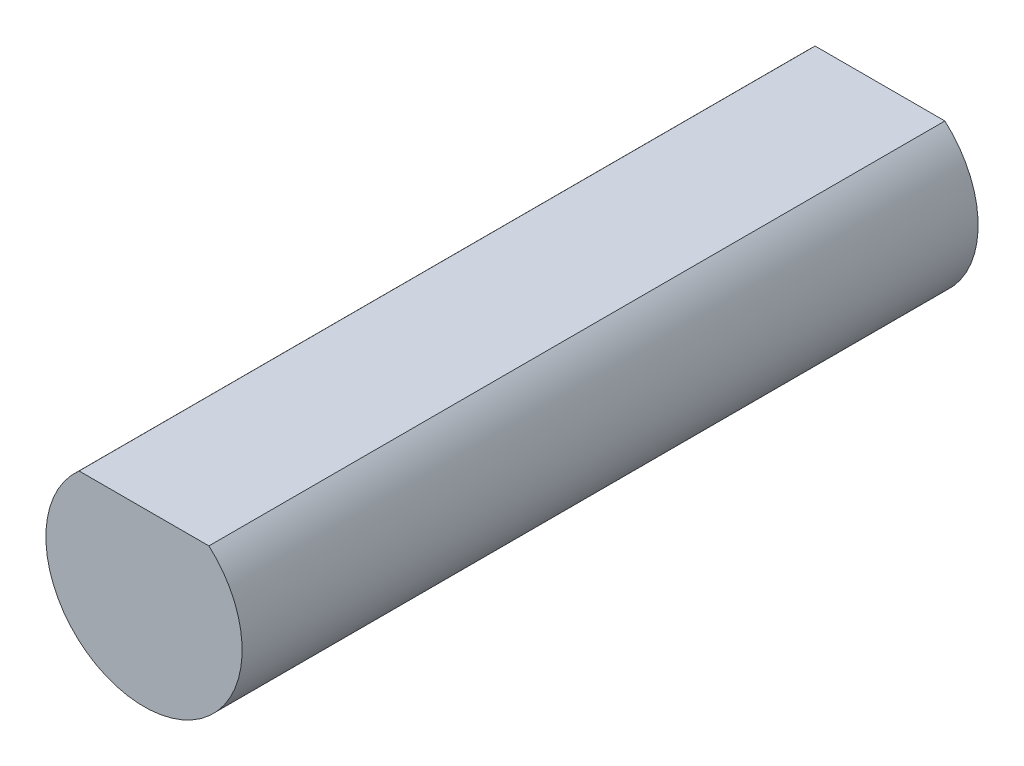
ISO-10303-21;
HEADER;
FILE_DESCRIPTION(('STEP AP214'),'2;1');
FILE_NAME('part.step','',(''),(''),'','','');
FILE_SCHEMA(('AUTOMOTIVE_DESIGN { 1 0 10303 214 1 1 1 1 }'));
ENDSEC;
DATA;
#1=APPLICATION_CONTEXT('core data for automotive mechanical design processes');
#2=APPLICATION_PROTOCOL_DEFINITION('international standard','automotive_design',2000,#1);
#3=PRODUCT_CONTEXT('',#1,'mechanical');
#4=PRODUCT('Part','Part','',(#3));
#5=PRODUCT_RELATED_PRODUCT_CATEGORY('part','',(#4));
#6=PRODUCT_DEFINITION_FORMATION('','',#4);
#7=PRODUCT_DEFINITION_CONTEXT('part definition',#1,'design');
#8=PRODUCT_DEFINITION('design','',#6,#7);
#9=PRODUCT_DEFINITION_SHAPE('','',#8);
#10=(LENGTH_UNIT() NAMED_UNIT(*) SI_UNIT(.MILLI.,.METRE.));
#11=(NAMED_UNIT(*) PLANE_ANGLE_UNIT() SI_UNIT($,.RADIAN.));
#12=(NAMED_UNIT(*) SI_UNIT($,.STERADIAN.) SOLID_ANGLE_UNIT());
#13=UNCERTAINTY_MEASURE_WITH_UNIT(LENGTH_MEASURE(1.E-05),#10,'distance_accuracy_value','');
#14=(GEOMETRIC_REPRESENTATION_CONTEXT(3) GLOBAL_UNCERTAINTY_ASSIGNED_CONTEXT((#13)) GLOBAL_UNIT_ASSIGNED_CONTEXT((#10,
#11,#12)) REPRESENTATION_CONTEXT('',''));
#15=CARTESIAN_POINT('',(0.,0.,0.));
#16=DIRECTION('',(0.,0.,1.));
#17=DIRECTION('',(1.,0.,0.));
#18=AXIS2_PLACEMENT_3D('',#15,#16,#17);
#19=CARTESIAN_POINT('',(0.,0.,15.));
#20=DIRECTION('',(0.,0.,-1.));
#21=DIRECTION('',(-1.,0.,0.));
#22=AXIS2_PLACEMENT_3D('',#19,#20,#21);
#23=CYLINDRICAL_SURFACE('',#22,2.);
#24=CARTESIAN_POINT('',(0.,0.,0.));
#25=DIRECTION('',(0.,0.,1.));
#26=DIRECTION('',(1.,0.,0.));
#27=AXIS2_PLACEMENT_3D('',#24,#25,#26);
#28=CIRCLE('',#27,2.);
#29=CARTESIAN_POINT('',(-1.3228756555323,1.5,0.));
#30=VERTEX_POINT('',#29);
#31=CARTESIAN_POINT('',(1.3228756555323,1.5,0.));
#32=VERTEX_POINT('',#31);
#33=EDGE_CURVE('E72',#30,#32,#28,.T.);
#34=ORIENTED_EDGE('',*,*,#33,.T.);
#35=DIRECTION('',(0.,0.,-1.));
#36=VECTOR('',#35,1.);
#37=CARTESIAN_POINT('',(1.3228756555323,1.5,15.));
#38=LINE('',#37,#36);
#39=CARTESIAN_POINT('',(1.3228756555323,1.5,15.));
#40=VERTEX_POINT('',#39);
#41=EDGE_CURVE('E11',#40,#32,#38,.T.);
#42=ORIENTED_EDGE('',*,*,#41,.F.);
#43=CARTESIAN_POINT('',(0.,0.,15.));
#44=DIRECTION('',(0.,0.,1.));
#45=DIRECTION('',(1.,0.,0.));
#46=AXIS2_PLACEMENT_3D('',#43,#44,#45);
#47=CIRCLE('',#46,2.);
#48=CARTESIAN_POINT('',(-1.3228756555323,1.5,15.));
#49=VERTEX_POINT('',#48);
#50=EDGE_CURVE('E71',#49,#40,#47,.T.);
#51=ORIENTED_EDGE('',*,*,#50,.F.);
#52=DIRECTION('',(0.,0.,-1.));
#53=VECTOR('',#52,1.);
#54=CARTESIAN_POINT('',(-1.3228756555323,1.5,15.));
#55=LINE('',#54,#53);
#56=EDGE_CURVE('E48',#49,#30,#55,.T.);
#57=ORIENTED_EDGE('',*,*,#56,.T.);
#58=EDGE_LOOP('',(#34,#42,#51,#57));
#59=FACE_BOUND('',#58,.T.);
#60=ADVANCED_FACE('F39',(#59),#23,.T.);
#61=CARTESIAN_POINT('',(-1.3228756555323,1.5,15.));
#62=DIRECTION('',(0.,-1.,0.));
#63=DIRECTION('',(0.,0.,-1.));
#64=AXIS2_PLACEMENT_3D('',#61,#62,#63);
#65=PLANE('',#64);
#66=DIRECTION('',(-1.,0.,0.));
#67=VECTOR('',#66,1.);
#68=CARTESIAN_POINT('',(-1.3228756555323,1.5,0.));
#69=LINE('',#68,#67);
#70=EDGE_CURVE('E63',#32,#30,#69,.T.);
#71=ORIENTED_EDGE('',*,*,#70,.T.);
#72=ORIENTED_EDGE('',*,*,#56,.F.);
#73=DIRECTION('',(-1.,0.,0.));
#74=VECTOR('',#73,1.);
#75=CARTESIAN_POINT('',(-1.3228756555323,1.5,15.));
#76=LINE('',#75,#74);
#77=EDGE_CURVE('E55',#40,#49,#76,.T.);
#78=ORIENTED_EDGE('',*,*,#77,.F.);
#79=ORIENTED_EDGE('',*,*,#41,.T.);
#80=EDGE_LOOP('',(#71,#72,#78,#79));
#81=FACE_BOUND('',#80,.T.);
#82=ADVANCED_FACE('F66',(#81),#65,.F.);
#83=CARTESIAN_POINT('',(0.,0.,15.));
#84=DIRECTION('',(0.,0.,1.));
#85=DIRECTION('',(1.,0.,0.));
#86=AXIS2_PLACEMENT_3D('',#83,#84,#85);
#87=PLANE('',#86);
#88=ORIENTED_EDGE('',*,*,#50,.T.);
#89=ORIENTED_EDGE('',*,*,#77,.T.);
#90=EDGE_LOOP('',(#88,#89));
#91=FACE_BOUND('',#90,.T.);
#92=ADVANCED_FACE('F83',(#91),#87,.T.);
#93=CARTESIAN_POINT('',(0.,0.,0.));
#94=DIRECTION('',(0.,0.,1.));
#95=DIRECTION('',(1.,0.,0.));
#96=AXIS2_PLACEMENT_3D('',#93,#94,#95);
#97=PLANE('',#96);
#98=ORIENTED_EDGE('',*,*,#33,.F.);
#99=ORIENTED_EDGE('',*,*,#70,.F.);
#100=EDGE_LOOP('',(#98,#99));
#101=FACE_BOUND('',#100,.T.);
#102=ADVANCED_FACE('F76',(#101),#97,.F.);
#103=CLOSED_SHELL('',(#60,#82,#92,#102));
#104=MANIFOLD_SOLID_BREP('B2',#103);
#105=ADVANCED_BREP_SHAPE_REPRESENTATION('',(#18,#104),#14);
#106=SHAPE_DEFINITION_REPRESENTATION(#9,#105);
ENDSEC;
END-ISO-10303-21;
